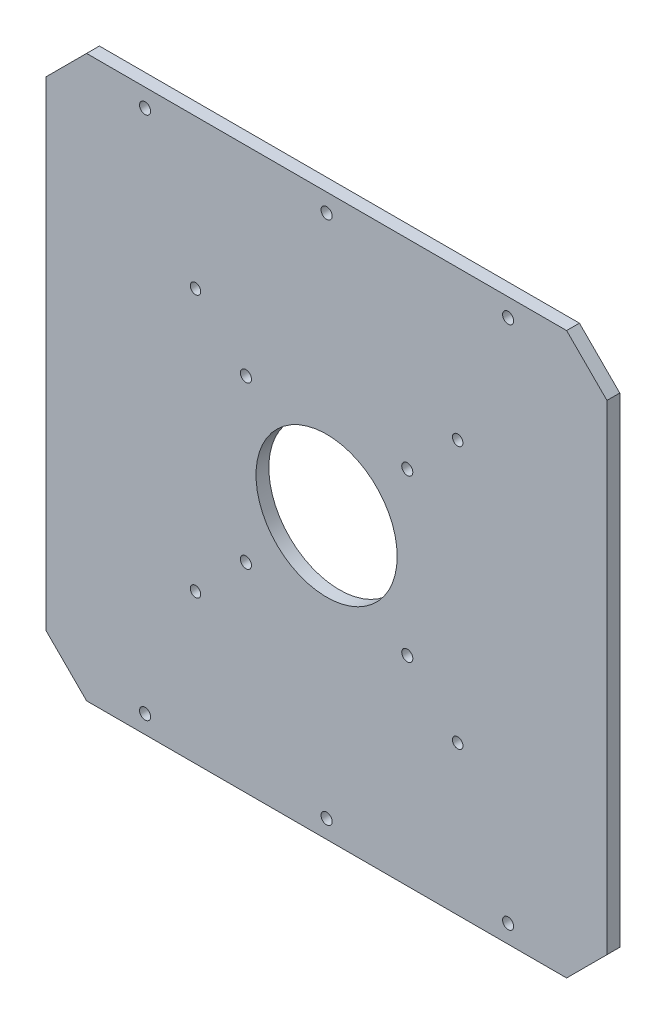
ISO-10303-21;
HEADER;
FILE_DESCRIPTION(('STEP AP214'),'2;1');
FILE_NAME('part.step','',(''),(''),'','','');
FILE_SCHEMA(('AUTOMOTIVE_DESIGN { 1 0 10303 214 1 1 1 1 }'));
ENDSEC;
DATA;
#1=APPLICATION_CONTEXT('core data for automotive mechanical design processes');
#2=APPLICATION_PROTOCOL_DEFINITION('international standard','automotive_design',2000,#1);
#3=PRODUCT_CONTEXT('',#1,'mechanical');
#4=PRODUCT('Part','Part','',(#3));
#5=PRODUCT_RELATED_PRODUCT_CATEGORY('part','',(#4));
#6=PRODUCT_DEFINITION_FORMATION('','',#4);
#7=PRODUCT_DEFINITION_CONTEXT('part definition',#1,'design');
#8=PRODUCT_DEFINITION('design','',#6,#7);
#9=PRODUCT_DEFINITION_SHAPE('','',#8);
#10=(LENGTH_UNIT() NAMED_UNIT(*) SI_UNIT(.MILLI.,.METRE.));
#11=(NAMED_UNIT(*) PLANE_ANGLE_UNIT() SI_UNIT($,.RADIAN.));
#12=(NAMED_UNIT(*) SI_UNIT($,.STERADIAN.) SOLID_ANGLE_UNIT());
#13=UNCERTAINTY_MEASURE_WITH_UNIT(LENGTH_MEASURE(1.E-05),#10,'distance_accuracy_value','');
#14=(GEOMETRIC_REPRESENTATION_CONTEXT(3) GLOBAL_UNCERTAINTY_ASSIGNED_CONTEXT((#13)) GLOBAL_UNIT_ASSIGNED_CONTEXT((#10,
#11,#12)) REPRESENTATION_CONTEXT('',''));
#15=CARTESIAN_POINT('',(0.,0.,0.));
#16=DIRECTION('',(0.,0.,1.));
#17=DIRECTION('',(1.,0.,0.));
#18=AXIS2_PLACEMENT_3D('',#15,#16,#17);
#19=CARTESIAN_POINT('',(-139.,-139.,6.35));
#20=DIRECTION('',(1.,0.,0.));
#21=DIRECTION('',(0.,0.,-1.));
#22=AXIS2_PLACEMENT_3D('',#19,#20,#21);
#23=PLANE('',#22);
#24=DIRECTION('',(0.,-1.,0.));
#25=VECTOR('',#24,1.);
#26=CARTESIAN_POINT('',(-139.,-139.,6.35));
#27=LINE('',#26,#25);
#28=CARTESIAN_POINT('',(-139.,119.,6.35));
#29=VERTEX_POINT('',#28);
#30=CARTESIAN_POINT('',(-139.,-119.,6.35));
#31=VERTEX_POINT('',#30);
#32=EDGE_CURVE('E130',#29,#31,#27,.T.);
#33=ORIENTED_EDGE('',*,*,#32,.F.);
#34=DIRECTION('',(0.,0.,-1.));
#35=VECTOR('',#34,1.);
#36=CARTESIAN_POINT('',(-139.,119.,6.35));
#37=LINE('',#36,#35);
#38=CARTESIAN_POINT('',(-139.,119.,0.));
#39=VERTEX_POINT('',#38);
#40=EDGE_CURVE('E11',#29,#39,#37,.T.);
#41=ORIENTED_EDGE('',*,*,#40,.T.);
#42=DIRECTION('',(0.,-1.,0.));
#43=VECTOR('',#42,1.);
#44=CARTESIAN_POINT('',(-139.,-139.,0.));
#45=LINE('',#44,#43);
#46=CARTESIAN_POINT('',(-139.,-119.,0.));
#47=VERTEX_POINT('',#46);
#48=EDGE_CURVE('E132',#39,#47,#45,.T.);
#49=ORIENTED_EDGE('',*,*,#48,.T.);
#50=DIRECTION('',(0.,0.,1.));
#51=VECTOR('',#50,1.);
#52=CARTESIAN_POINT('',(-139.,-119.,6.35));
#53=LINE('',#52,#51);
#54=EDGE_CURVE('E42',#47,#31,#53,.T.);
#55=ORIENTED_EDGE('',*,*,#54,.T.);
#56=EDGE_LOOP('',(#33,#41,#49,#55));
#57=FACE_BOUND('',#56,.T.);
#58=ADVANCED_FACE('F33',(#57),#23,.F.);
#59=CARTESIAN_POINT('',(139.,-139.,6.35));
#60=DIRECTION('',(0.,1.,0.));
#61=DIRECTION('',(0.,0.,1.));
#62=AXIS2_PLACEMENT_3D('',#59,#60,#61);
#63=PLANE('',#62);
#64=DIRECTION('',(1.,0.,0.));
#65=VECTOR('',#64,1.);
#66=CARTESIAN_POINT('',(139.,-139.,0.));
#67=LINE('',#66,#65);
#68=CARTESIAN_POINT('',(-119.,-139.,0.));
#69=VERTEX_POINT('',#68);
#70=CARTESIAN_POINT('',(119.,-139.,0.));
#71=VERTEX_POINT('',#70);
#72=EDGE_CURVE('E128',#69,#71,#67,.T.);
#73=ORIENTED_EDGE('',*,*,#72,.T.);
#74=DIRECTION('',(0.,0.,1.));
#75=VECTOR('',#74,1.);
#76=CARTESIAN_POINT('',(119.,-139.,6.35));
#77=LINE('',#76,#75);
#78=CARTESIAN_POINT('',(119.,-139.,6.35));
#79=VERTEX_POINT('',#78);
#80=EDGE_CURVE('E107',#71,#79,#77,.T.);
#81=ORIENTED_EDGE('',*,*,#80,.T.);
#82=DIRECTION('',(1.,0.,0.));
#83=VECTOR('',#82,1.);
#84=CARTESIAN_POINT('',(139.,-139.,6.35));
#85=LINE('',#84,#83);
#86=CARTESIAN_POINT('',(-119.,-139.,6.35));
#87=VERTEX_POINT('',#86);
#88=EDGE_CURVE('E226',#87,#79,#85,.T.);
#89=ORIENTED_EDGE('',*,*,#88,.F.);
#90=DIRECTION('',(0.,0.,-1.));
#91=VECTOR('',#90,1.);
#92=CARTESIAN_POINT('',(-119.,-139.,6.35));
#93=LINE('',#92,#91);
#94=EDGE_CURVE('E112',#87,#69,#93,.T.);
#95=ORIENTED_EDGE('',*,*,#94,.T.);
#96=EDGE_LOOP('',(#73,#81,#89,#95));
#97=FACE_BOUND('',#96,.T.);
#98=ADVANCED_FACE('F242',(#97),#63,.F.);
#99=CARTESIAN_POINT('',(139.,-139.,6.35));
#100=DIRECTION('',(-1.,0.,0.));
#101=DIRECTION('',(0.,0.,1.));
#102=AXIS2_PLACEMENT_3D('',#99,#100,#101);
#103=PLANE('',#102);
#104=DIRECTION('',(0.,1.,0.));
#105=VECTOR('',#104,1.);
#106=CARTESIAN_POINT('',(139.,-139.,6.35));
#107=LINE('',#106,#105);
#108=CARTESIAN_POINT('',(139.,-119.,6.35));
#109=VERTEX_POINT('',#108);
#110=CARTESIAN_POINT('',(139.,119.,6.35));
#111=VERTEX_POINT('',#110);
#112=EDGE_CURVE('E121',#109,#111,#107,.T.);
#113=ORIENTED_EDGE('',*,*,#112,.F.);
#114=DIRECTION('',(0.,0.,-1.));
#115=VECTOR('',#114,1.);
#116=CARTESIAN_POINT('',(139.,-119.,6.35));
#117=LINE('',#116,#115);
#118=CARTESIAN_POINT('',(139.,-119.,0.));
#119=VERTEX_POINT('',#118);
#120=EDGE_CURVE('E106',#109,#119,#117,.T.);
#121=ORIENTED_EDGE('',*,*,#120,.T.);
#122=DIRECTION('',(0.,1.,0.));
#123=VECTOR('',#122,1.);
#124=CARTESIAN_POINT('',(139.,-139.,0.));
#125=LINE('',#124,#123);
#126=CARTESIAN_POINT('',(139.,119.,0.));
#127=VERTEX_POINT('',#126);
#128=EDGE_CURVE('E119',#119,#127,#125,.T.);
#129=ORIENTED_EDGE('',*,*,#128,.T.);
#130=DIRECTION('',(0.,0.,1.));
#131=VECTOR('',#130,1.);
#132=CARTESIAN_POINT('',(139.,119.,6.35));
#133=LINE('',#132,#131);
#134=EDGE_CURVE('E123',#127,#111,#133,.T.);
#135=ORIENTED_EDGE('',*,*,#134,.T.);
#136=EDGE_LOOP('',(#113,#121,#129,#135));
#137=FACE_BOUND('',#136,.T.);
#138=ADVANCED_FACE('F118',(#137),#103,.F.);
#139=CARTESIAN_POINT('',(139.,139.,6.35));
#140=DIRECTION('',(0.,-1.,0.));
#141=DIRECTION('',(0.,0.,-1.));
#142=AXIS2_PLACEMENT_3D('',#139,#140,#141);
#143=PLANE('',#142);
#144=DIRECTION('',(-1.,0.,0.));
#145=VECTOR('',#144,1.);
#146=CARTESIAN_POINT('',(139.,139.,6.35));
#147=LINE('',#146,#145);
#148=CARTESIAN_POINT('',(119.,139.,6.35));
#149=VERTEX_POINT('',#148);
#150=CARTESIAN_POINT('',(-119.,139.,6.35));
#151=VERTEX_POINT('',#150);
#152=EDGE_CURVE('E136',#149,#151,#147,.T.);
#153=ORIENTED_EDGE('',*,*,#152,.F.);
#154=DIRECTION('',(0.,0.,-1.));
#155=VECTOR('',#154,1.);
#156=CARTESIAN_POINT('',(119.,139.,6.35));
#157=LINE('',#156,#155);
#158=CARTESIAN_POINT('',(119.,139.,0.));
#159=VERTEX_POINT('',#158);
#160=EDGE_CURVE('E153',#149,#159,#157,.T.);
#161=ORIENTED_EDGE('',*,*,#160,.T.);
#162=DIRECTION('',(-1.,0.,0.));
#163=VECTOR('',#162,1.);
#164=CARTESIAN_POINT('',(139.,139.,0.));
#165=LINE('',#164,#163);
#166=CARTESIAN_POINT('',(-119.,139.,0.));
#167=VERTEX_POINT('',#166);
#168=EDGE_CURVE('E127',#159,#167,#165,.T.);
#169=ORIENTED_EDGE('',*,*,#168,.T.);
#170=DIRECTION('',(0.,0.,1.));
#171=VECTOR('',#170,1.);
#172=CARTESIAN_POINT('',(-119.,139.,6.35));
#173=LINE('',#172,#171);
#174=EDGE_CURVE('E50',#167,#151,#173,.T.);
#175=ORIENTED_EDGE('',*,*,#174,.T.);
#176=EDGE_LOOP('',(#153,#161,#169,#175));
#177=FACE_BOUND('',#176,.T.);
#178=ADVANCED_FACE('F249',(#177),#143,.F.);
#179=CARTESIAN_POINT('',(0.,0.,6.35));
#180=DIRECTION('',(0.,0.,1.));
#181=DIRECTION('',(1.,0.,0.));
#182=AXIS2_PLACEMENT_3D('',#179,#180,#181);
#183=PLANE('',#182);
#184=CARTESIAN_POINT('',(65.,65.,6.35));
#185=DIRECTION('',(0.,0.,-1.));
#186=DIRECTION('',(1.,0.,0.));
#187=AXIS2_PLACEMENT_3D('',#184,#185,#186);
#188=CIRCLE('',#187,2.6);
#189=CARTESIAN_POINT('',(67.6,65.,6.35));
#190=VERTEX_POINT('',#189);
#191=EDGE_CURVE('E340',#190,#190,#188,.T.);
#192=ORIENTED_EDGE('',*,*,#191,.T.);
#193=EDGE_LOOP('',(#192));
#194=FACE_BOUND('',#193,.T.);
#195=CARTESIAN_POINT('',(65.,-65.,6.35));
#196=DIRECTION('',(0.,0.,-1.));
#197=DIRECTION('',(-1.,0.,0.));
#198=AXIS2_PLACEMENT_3D('',#195,#196,#197);
#199=CIRCLE('',#198,2.6);
#200=CARTESIAN_POINT('',(62.4,-65.,6.35));
#201=VERTEX_POINT('',#200);
#202=EDGE_CURVE('E348',#201,#201,#199,.T.);
#203=ORIENTED_EDGE('',*,*,#202,.T.);
#204=EDGE_LOOP('',(#203));
#205=FACE_BOUND('',#204,.T.);
#206=CARTESIAN_POINT('',(-65.,-65.,6.35));
#207=DIRECTION('',(0.,0.,-1.));
#208=DIRECTION('',(1.,0.,0.));
#209=AXIS2_PLACEMENT_3D('',#206,#207,#208);
#210=CIRCLE('',#209,2.6);
#211=CARTESIAN_POINT('',(-62.4,-65.,6.35));
#212=VERTEX_POINT('',#211);
#213=EDGE_CURVE('E354',#212,#212,#210,.T.);
#214=ORIENTED_EDGE('',*,*,#213,.T.);
#215=EDGE_LOOP('',(#214));
#216=FACE_BOUND('',#215,.T.);
#217=CARTESIAN_POINT('',(-65.,65.,6.35));
#218=DIRECTION('',(0.,0.,-1.));
#219=DIRECTION('',(-1.,0.,0.));
#220=AXIS2_PLACEMENT_3D('',#217,#218,#219);
#221=CIRCLE('',#220,2.6);
#222=CARTESIAN_POINT('',(-67.6,65.,6.35));
#223=VERTEX_POINT('',#222);
#224=EDGE_CURVE('E360',#223,#223,#221,.T.);
#225=ORIENTED_EDGE('',*,*,#224,.T.);
#226=EDGE_LOOP('',(#225));
#227=FACE_BOUND('',#226,.T.);
#228=CARTESIAN_POINT('',(-90.,-130.,6.35));
#229=DIRECTION('',(0.,0.,1.));
#230=DIRECTION('',(-1.,0.,0.));
#231=AXIS2_PLACEMENT_3D('',#228,#229,#230);
#232=CIRCLE('',#231,2.75000000000001);
#233=CARTESIAN_POINT('',(-92.75,-130.,6.35));
#234=VERTEX_POINT('',#233);
#235=EDGE_CURVE('E185',#234,#234,#232,.T.);
#236=ORIENTED_EDGE('',*,*,#235,.F.);
#237=EDGE_LOOP('',(#236));
#238=FACE_BOUND('',#237,.T.);
#239=CARTESIAN_POINT('',(0.,-130.,6.35));
#240=DIRECTION('',(0.,0.,1.));
#241=DIRECTION('',(-1.,0.,0.));
#242=AXIS2_PLACEMENT_3D('',#239,#240,#241);
#243=CIRCLE('',#242,2.75);
#244=CARTESIAN_POINT('',(-2.74999999999996,-130.,6.35));
#245=VERTEX_POINT('',#244);
#246=EDGE_CURVE('E175',#245,#245,#243,.T.);
#247=ORIENTED_EDGE('',*,*,#246,.F.);
#248=EDGE_LOOP('',(#247));
#249=FACE_BOUND('',#248,.T.);
#250=CARTESIAN_POINT('',(90.0000000000001,-130.,6.35));
#251=DIRECTION('',(0.,0.,1.));
#252=DIRECTION('',(1.,0.,0.));
#253=AXIS2_PLACEMENT_3D('',#250,#251,#252);
#254=CIRCLE('',#253,2.75000000000001);
#255=CARTESIAN_POINT('',(92.7500000000001,-130.,6.35));
#256=VERTEX_POINT('',#255);
#257=EDGE_CURVE('E172',#256,#256,#254,.T.);
#258=ORIENTED_EDGE('',*,*,#257,.F.);
#259=EDGE_LOOP('',(#258));
#260=FACE_BOUND('',#259,.T.);
#261=CARTESIAN_POINT('',(90.,130.,6.35));
#262=DIRECTION('',(0.,0.,1.));
#263=DIRECTION('',(-1.,0.,0.));
#264=AXIS2_PLACEMENT_3D('',#261,#262,#263);
#265=CIRCLE('',#264,2.75000000000001);
#266=CARTESIAN_POINT('',(87.25,130.,6.35));
#267=VERTEX_POINT('',#266);
#268=EDGE_CURVE('E169',#267,#267,#265,.T.);
#269=ORIENTED_EDGE('',*,*,#268,.F.);
#270=EDGE_LOOP('',(#269));
#271=FACE_BOUND('',#270,.T.);
#272=CARTESIAN_POINT('',(0.,130.,6.35));
#273=DIRECTION('',(0.,0.,1.));
#274=DIRECTION('',(1.,0.,0.));
#275=AXIS2_PLACEMENT_3D('',#272,#273,#274);
#276=CIRCLE('',#275,2.75);
#277=CARTESIAN_POINT('',(2.75000000000002,130.,6.35));
#278=VERTEX_POINT('',#277);
#279=EDGE_CURVE('E165',#278,#278,#276,.T.);
#280=ORIENTED_EDGE('',*,*,#279,.F.);
#281=EDGE_LOOP('',(#280));
#282=FACE_BOUND('',#281,.T.);
#283=CARTESIAN_POINT('',(-90.,130.,6.35));
#284=DIRECTION('',(0.,0.,1.));
#285=DIRECTION('',(1.,0.,0.));
#286=AXIS2_PLACEMENT_3D('',#283,#284,#285);
#287=CIRCLE('',#286,2.75000000000001);
#288=CARTESIAN_POINT('',(-87.25,130.,6.35));
#289=VERTEX_POINT('',#288);
#290=EDGE_CURVE('E161',#289,#289,#287,.T.);
#291=ORIENTED_EDGE('',*,*,#290,.F.);
#292=EDGE_LOOP('',(#291));
#293=FACE_BOUND('',#292,.T.);
#294=CARTESIAN_POINT('',(-40.,-40.,6.35));
#295=DIRECTION('',(0.,0.,1.));
#296=DIRECTION('',(-1.,0.,0.));
#297=AXIS2_PLACEMENT_3D('',#294,#295,#296);
#298=CIRCLE('',#297,2.75);
#299=CARTESIAN_POINT('',(-42.75,-40.,6.35));
#300=VERTEX_POINT('',#299);
#301=EDGE_CURVE('E160',#300,#300,#298,.T.);
#302=ORIENTED_EDGE('',*,*,#301,.F.);
#303=EDGE_LOOP('',(#302));
#304=FACE_BOUND('',#303,.T.);
#305=CARTESIAN_POINT('',(40.,-40.,6.35));
#306=DIRECTION('',(0.,0.,1.));
#307=DIRECTION('',(1.,0.,0.));
#308=AXIS2_PLACEMENT_3D('',#305,#306,#307);
#309=CIRCLE('',#308,2.75);
#310=CARTESIAN_POINT('',(42.75,-40.,6.35));
#311=VERTEX_POINT('',#310);
#312=EDGE_CURVE('E198',#311,#311,#309,.T.);
#313=ORIENTED_EDGE('',*,*,#312,.F.);
#314=EDGE_LOOP('',(#313));
#315=FACE_BOUND('',#314,.T.);
#316=CARTESIAN_POINT('',(40.,40.,6.35));
#317=DIRECTION('',(0.,0.,1.));
#318=DIRECTION('',(-1.,0.,0.));
#319=AXIS2_PLACEMENT_3D('',#316,#317,#318);
#320=CIRCLE('',#319,2.75);
#321=CARTESIAN_POINT('',(37.25,40.,6.35));
#322=VERTEX_POINT('',#321);
#323=EDGE_CURVE('E204',#322,#322,#320,.T.);
#324=ORIENTED_EDGE('',*,*,#323,.F.);
#325=EDGE_LOOP('',(#324));
#326=FACE_BOUND('',#325,.T.);
#327=CARTESIAN_POINT('',(-40.,40.,6.35));
#328=DIRECTION('',(0.,0.,1.));
#329=DIRECTION('',(1.,0.,0.));
#330=AXIS2_PLACEMENT_3D('',#327,#328,#329);
#331=CIRCLE('',#330,2.75);
#332=CARTESIAN_POINT('',(-37.25,40.,6.35));
#333=VERTEX_POINT('',#332);
#334=EDGE_CURVE('E210',#333,#333,#331,.T.);
#335=ORIENTED_EDGE('',*,*,#334,.F.);
#336=EDGE_LOOP('',(#335));
#337=FACE_BOUND('',#336,.T.);
#338=CARTESIAN_POINT('',(0.,0.,6.35));
#339=DIRECTION('',(0.,0.,1.));
#340=DIRECTION('',(1.,0.,0.));
#341=AXIS2_PLACEMENT_3D('',#338,#339,#340);
#342=CIRCLE('',#341,35.);
#343=CARTESIAN_POINT('',(35.,0.,6.35));
#344=VERTEX_POINT('',#343);
#345=EDGE_CURVE('E216',#344,#344,#342,.T.);
#346=ORIENTED_EDGE('',*,*,#345,.F.);
#347=EDGE_LOOP('',(#346));
#348=FACE_BOUND('',#347,.T.);
#349=ORIENTED_EDGE('',*,*,#88,.T.);
#350=DIRECTION('',(-0.70710678118655,-0.707106781186546,0.));
#351=VECTOR('',#350,1.);
#352=CARTESIAN_POINT('',(129.,-129.,6.35));
#353=LINE('',#352,#351);
#354=EDGE_CURVE('E150',#79,#109,#353,.F.);
#355=ORIENTED_EDGE('',*,*,#354,.T.);
#356=ORIENTED_EDGE('',*,*,#112,.T.);
#357=DIRECTION('',(0.707106781186546,-0.70710678118655,0.));
#358=VECTOR('',#357,1.);
#359=CARTESIAN_POINT('',(129.,129.,6.35));
#360=LINE('',#359,#358);
#361=EDGE_CURVE('E57',#111,#149,#360,.F.);
#362=ORIENTED_EDGE('',*,*,#361,.T.);
#363=ORIENTED_EDGE('',*,*,#152,.T.);
#364=DIRECTION('',(0.70710678118655,0.707106781186546,0.));
#365=VECTOR('',#364,1.);
#366=CARTESIAN_POINT('',(-129.,129.,6.35));
#367=LINE('',#366,#365);
#368=EDGE_CURVE('E147',#151,#29,#367,.F.);
#369=ORIENTED_EDGE('',*,*,#368,.T.);
#370=ORIENTED_EDGE('',*,*,#32,.T.);
#371=DIRECTION('',(-0.707106781186546,0.70710678118655,0.));
#372=VECTOR('',#371,1.);
#373=CARTESIAN_POINT('',(-129.,-129.,6.35));
#374=LINE('',#373,#372);
#375=EDGE_CURVE('E145',#31,#87,#374,.F.);
#376=ORIENTED_EDGE('',*,*,#375,.T.);
#377=EDGE_LOOP('',(#349,#355,#356,#362,#363,#369,#370,#376));
#378=FACE_BOUND('',#377,.T.);
#379=ADVANCED_FACE('F240',(#194,#205,#216,#227,#238,#249,#260,#271,#282,#293,#304,#315,#326,
#337,#348,#378),#183,.T.);
#380=CARTESIAN_POINT('',(0.,0.,0.));
#381=DIRECTION('',(0.,0.,1.));
#382=DIRECTION('',(1.,0.,0.));
#383=AXIS2_PLACEMENT_3D('',#380,#381,#382);
#384=PLANE('',#383);
#385=CARTESIAN_POINT('',(65.,65.,0.));
#386=DIRECTION('',(0.,0.,-1.));
#387=DIRECTION('',(1.,0.,0.));
#388=AXIS2_PLACEMENT_3D('',#385,#386,#387);
#389=CIRCLE('',#388,2.6);
#390=CARTESIAN_POINT('',(67.6,65.,0.));
#391=VERTEX_POINT('',#390);
#392=EDGE_CURVE('E343',#391,#391,#389,.T.);
#393=ORIENTED_EDGE('',*,*,#392,.F.);
#394=EDGE_LOOP('',(#393));
#395=FACE_BOUND('',#394,.T.);
#396=CARTESIAN_POINT('',(65.,-65.,0.));
#397=DIRECTION('',(0.,0.,-1.));
#398=DIRECTION('',(-1.,0.,0.));
#399=AXIS2_PLACEMENT_3D('',#396,#397,#398);
#400=CIRCLE('',#399,2.6);
#401=CARTESIAN_POINT('',(62.4,-65.,0.));
#402=VERTEX_POINT('',#401);
#403=EDGE_CURVE('E345',#402,#402,#400,.T.);
#404=ORIENTED_EDGE('',*,*,#403,.F.);
#405=EDGE_LOOP('',(#404));
#406=FACE_BOUND('',#405,.T.);
#407=CARTESIAN_POINT('',(-65.,-65.,0.));
#408=DIRECTION('',(0.,0.,-1.));
#409=DIRECTION('',(1.,0.,0.));
#410=AXIS2_PLACEMENT_3D('',#407,#408,#409);
#411=CIRCLE('',#410,2.6);
#412=CARTESIAN_POINT('',(-62.4,-65.,0.));
#413=VERTEX_POINT('',#412);
#414=EDGE_CURVE('E351',#413,#413,#411,.T.);
#415=ORIENTED_EDGE('',*,*,#414,.F.);
#416=EDGE_LOOP('',(#415));
#417=FACE_BOUND('',#416,.T.);
#418=CARTESIAN_POINT('',(-65.,65.,0.));
#419=DIRECTION('',(0.,0.,-1.));
#420=DIRECTION('',(-1.,0.,0.));
#421=AXIS2_PLACEMENT_3D('',#418,#419,#420);
#422=CIRCLE('',#421,2.6);
#423=CARTESIAN_POINT('',(-67.6,65.,0.));
#424=VERTEX_POINT('',#423);
#425=EDGE_CURVE('E357',#424,#424,#422,.T.);
#426=ORIENTED_EDGE('',*,*,#425,.F.);
#427=EDGE_LOOP('',(#426));
#428=FACE_BOUND('',#427,.T.);
#429=CARTESIAN_POINT('',(-90.,-130.,0.));
#430=DIRECTION('',(0.,0.,1.));
#431=DIRECTION('',(1.,0.,0.));
#432=AXIS2_PLACEMENT_3D('',#429,#430,#431);
#433=CIRCLE('',#432,2.75000000000001);
#434=CARTESIAN_POINT('',(-87.25,-130.,0.));
#435=VERTEX_POINT('',#434);
#436=EDGE_CURVE('E37',#435,#435,#433,.T.);
#437=ORIENTED_EDGE('',*,*,#436,.T.);
#438=EDGE_LOOP('',(#437));
#439=FACE_BOUND('',#438,.T.);
#440=CARTESIAN_POINT('',(0.,-130.,0.));
#441=DIRECTION('',(0.,0.,1.));
#442=DIRECTION('',(1.,0.,0.));
#443=AXIS2_PLACEMENT_3D('',#440,#441,#442);
#444=CIRCLE('',#443,2.75);
#445=CARTESIAN_POINT('',(2.75000000000005,-130.,0.));
#446=VERTEX_POINT('',#445);
#447=EDGE_CURVE('E173',#446,#446,#444,.T.);
#448=ORIENTED_EDGE('',*,*,#447,.T.);
#449=EDGE_LOOP('',(#448));
#450=FACE_BOUND('',#449,.T.);
#451=CARTESIAN_POINT('',(90.0000000000001,-130.,0.));
#452=DIRECTION('',(0.,0.,1.));
#453=DIRECTION('',(1.,0.,0.));
#454=AXIS2_PLACEMENT_3D('',#451,#452,#453);
#455=CIRCLE('',#454,2.75000000000001);
#456=CARTESIAN_POINT('',(92.7500000000001,-130.,0.));
#457=VERTEX_POINT('',#456);
#458=EDGE_CURVE('E170',#457,#457,#455,.T.);
#459=ORIENTED_EDGE('',*,*,#458,.T.);
#460=EDGE_LOOP('',(#459));
#461=FACE_BOUND('',#460,.T.);
#462=CARTESIAN_POINT('',(90.,130.,0.));
#463=DIRECTION('',(0.,0.,1.));
#464=DIRECTION('',(1.,0.,0.));
#465=AXIS2_PLACEMENT_3D('',#462,#463,#464);
#466=CIRCLE('',#465,2.75000000000001);
#467=CARTESIAN_POINT('',(92.75,130.,0.));
#468=VERTEX_POINT('',#467);
#469=EDGE_CURVE('E166',#468,#468,#466,.T.);
#470=ORIENTED_EDGE('',*,*,#469,.T.);
#471=EDGE_LOOP('',(#470));
#472=FACE_BOUND('',#471,.T.);
#473=CARTESIAN_POINT('',(0.,130.,0.));
#474=DIRECTION('',(0.,0.,1.));
#475=DIRECTION('',(1.,0.,0.));
#476=AXIS2_PLACEMENT_3D('',#473,#474,#475);
#477=CIRCLE('',#476,2.75);
#478=CARTESIAN_POINT('',(2.75000000000002,130.,0.));
#479=VERTEX_POINT('',#478);
#480=EDGE_CURVE('E162',#479,#479,#477,.T.);
#481=ORIENTED_EDGE('',*,*,#480,.T.);
#482=EDGE_LOOP('',(#481));
#483=FACE_BOUND('',#482,.T.);
#484=CARTESIAN_POINT('',(-90.,130.,0.));
#485=DIRECTION('',(0.,0.,1.));
#486=DIRECTION('',(1.,0.,0.));
#487=AXIS2_PLACEMENT_3D('',#484,#485,#486);
#488=CIRCLE('',#487,2.75000000000001);
#489=CARTESIAN_POINT('',(-87.25,130.,0.));
#490=VERTEX_POINT('',#489);
#491=EDGE_CURVE('E157',#490,#490,#488,.T.);
#492=ORIENTED_EDGE('',*,*,#491,.T.);
#493=EDGE_LOOP('',(#492));
#494=FACE_BOUND('',#493,.T.);
#495=CARTESIAN_POINT('',(-40.,-40.,0.));
#496=DIRECTION('',(0.,0.,1.));
#497=DIRECTION('',(-1.,0.,0.));
#498=AXIS2_PLACEMENT_3D('',#495,#496,#497);
#499=CIRCLE('',#498,2.75);
#500=CARTESIAN_POINT('',(-42.75,-40.,0.));
#501=VERTEX_POINT('',#500);
#502=EDGE_CURVE('E195',#501,#501,#499,.T.);
#503=ORIENTED_EDGE('',*,*,#502,.T.);
#504=EDGE_LOOP('',(#503));
#505=FACE_BOUND('',#504,.T.);
#506=CARTESIAN_POINT('',(40.,-40.,0.));
#507=DIRECTION('',(0.,0.,1.));
#508=DIRECTION('',(1.,0.,0.));
#509=AXIS2_PLACEMENT_3D('',#506,#507,#508);
#510=CIRCLE('',#509,2.75);
#511=CARTESIAN_POINT('',(42.75,-40.,0.));
#512=VERTEX_POINT('',#511);
#513=EDGE_CURVE('E201',#512,#512,#510,.T.);
#514=ORIENTED_EDGE('',*,*,#513,.T.);
#515=EDGE_LOOP('',(#514));
#516=FACE_BOUND('',#515,.T.);
#517=CARTESIAN_POINT('',(40.,40.,0.));
#518=DIRECTION('',(0.,0.,1.));
#519=DIRECTION('',(-1.,0.,0.));
#520=AXIS2_PLACEMENT_3D('',#517,#518,#519);
#521=CIRCLE('',#520,2.75);
#522=CARTESIAN_POINT('',(37.25,40.,0.));
#523=VERTEX_POINT('',#522);
#524=EDGE_CURVE('E207',#523,#523,#521,.T.);
#525=ORIENTED_EDGE('',*,*,#524,.T.);
#526=EDGE_LOOP('',(#525));
#527=FACE_BOUND('',#526,.T.);
#528=CARTESIAN_POINT('',(-40.,40.,0.));
#529=DIRECTION('',(0.,0.,1.));
#530=DIRECTION('',(1.,0.,0.));
#531=AXIS2_PLACEMENT_3D('',#528,#529,#530);
#532=CIRCLE('',#531,2.75);
#533=CARTESIAN_POINT('',(-37.25,40.,0.));
#534=VERTEX_POINT('',#533);
#535=EDGE_CURVE('E213',#534,#534,#532,.T.);
#536=ORIENTED_EDGE('',*,*,#535,.T.);
#537=EDGE_LOOP('',(#536));
#538=FACE_BOUND('',#537,.T.);
#539=CARTESIAN_POINT('',(0.,0.,0.));
#540=DIRECTION('',(0.,0.,1.));
#541=DIRECTION('',(1.,0.,0.));
#542=AXIS2_PLACEMENT_3D('',#539,#540,#541);
#543=CIRCLE('',#542,35.);
#544=CARTESIAN_POINT('',(35.,0.,0.));
#545=VERTEX_POINT('',#544);
#546=EDGE_CURVE('E219',#545,#545,#543,.T.);
#547=ORIENTED_EDGE('',*,*,#546,.T.);
#548=EDGE_LOOP('',(#547));
#549=FACE_BOUND('',#548,.T.);
#550=ORIENTED_EDGE('',*,*,#128,.F.);
#551=DIRECTION('',(0.70710678118655,0.707106781186546,0.));
#552=VECTOR('',#551,1.);
#553=CARTESIAN_POINT('',(139.,-119.,0.));
#554=LINE('',#553,#552);
#555=EDGE_CURVE('E102',#119,#71,#554,.F.);
#556=ORIENTED_EDGE('',*,*,#555,.T.);
#557=ORIENTED_EDGE('',*,*,#72,.F.);
#558=DIRECTION('',(0.707106781186546,-0.70710678118655,0.));
#559=VECTOR('',#558,1.);
#560=CARTESIAN_POINT('',(-119.,-139.,0.));
#561=LINE('',#560,#559);
#562=EDGE_CURVE('E122',#69,#47,#561,.F.);
#563=ORIENTED_EDGE('',*,*,#562,.T.);
#564=ORIENTED_EDGE('',*,*,#48,.F.);
#565=DIRECTION('',(-0.70710678118655,-0.707106781186546,0.));
#566=VECTOR('',#565,1.);
#567=CARTESIAN_POINT('',(-139.,119.,0.));
#568=LINE('',#567,#566);
#569=EDGE_CURVE('E139',#39,#167,#568,.F.);
#570=ORIENTED_EDGE('',*,*,#569,.T.);
#571=ORIENTED_EDGE('',*,*,#168,.F.);
#572=DIRECTION('',(-0.707106781186546,0.70710678118655,0.));
#573=VECTOR('',#572,1.);
#574=CARTESIAN_POINT('',(119.,139.,0.));
#575=LINE('',#574,#573);
#576=EDGE_CURVE('E113',#159,#127,#575,.F.);
#577=ORIENTED_EDGE('',*,*,#576,.T.);
#578=EDGE_LOOP('',(#550,#556,#557,#563,#564,#570,#571,#577));
#579=FACE_BOUND('',#578,.T.);
#580=ADVANCED_FACE('F125',(#395,#406,#417,#428,#439,#450,#461,#472,#483,#494,#505,#516,#527,
#538,#549,#579),#384,.F.);
#581=CARTESIAN_POINT('',(0.,0.,0.));
#582=DIRECTION('',(0.,0.,1.));
#583=DIRECTION('',(1.,0.,0.));
#584=AXIS2_PLACEMENT_3D('',#581,#582,#583);
#585=CYLINDRICAL_SURFACE('',#584,35.);
#586=ORIENTED_EDGE('',*,*,#546,.F.);
#587=EDGE_LOOP('',(#586));
#588=FACE_BOUND('',#587,.T.);
#589=ORIENTED_EDGE('',*,*,#345,.T.);
#590=EDGE_LOOP('',(#589));
#591=FACE_BOUND('',#590,.T.);
#592=ADVANCED_FACE('F277',(#588,#591),#585,.F.);
#593=CARTESIAN_POINT('',(-40.,40.,0.));
#594=DIRECTION('',(0.,0.,1.));
#595=DIRECTION('',(1.,0.,0.));
#596=AXIS2_PLACEMENT_3D('',#593,#594,#595);
#597=CYLINDRICAL_SURFACE('',#596,2.75);
#598=ORIENTED_EDGE('',*,*,#535,.F.);
#599=EDGE_LOOP('',(#598));
#600=FACE_BOUND('',#599,.T.);
#601=ORIENTED_EDGE('',*,*,#334,.T.);
#602=EDGE_LOOP('',(#601));
#603=FACE_BOUND('',#602,.T.);
#604=ADVANCED_FACE('F282',(#600,#603),#597,.F.);
#605=CARTESIAN_POINT('',(40.,40.,0.));
#606=DIRECTION('',(0.,0.,1.));
#607=DIRECTION('',(1.,0.,0.));
#608=AXIS2_PLACEMENT_3D('',#605,#606,#607);
#609=CYLINDRICAL_SURFACE('',#608,2.75);
#610=ORIENTED_EDGE('',*,*,#524,.F.);
#611=EDGE_LOOP('',(#610));
#612=FACE_BOUND('',#611,.T.);
#613=ORIENTED_EDGE('',*,*,#323,.T.);
#614=EDGE_LOOP('',(#613));
#615=FACE_BOUND('',#614,.T.);
#616=ADVANCED_FACE('F286',(#612,#615),#609,.F.);
#617=CARTESIAN_POINT('',(40.,-40.,0.));
#618=DIRECTION('',(0.,0.,1.));
#619=DIRECTION('',(1.,0.,0.));
#620=AXIS2_PLACEMENT_3D('',#617,#618,#619);
#621=CYLINDRICAL_SURFACE('',#620,2.75);
#622=ORIENTED_EDGE('',*,*,#513,.F.);
#623=EDGE_LOOP('',(#622));
#624=FACE_BOUND('',#623,.T.);
#625=ORIENTED_EDGE('',*,*,#312,.T.);
#626=EDGE_LOOP('',(#625));
#627=FACE_BOUND('',#626,.T.);
#628=ADVANCED_FACE('F290',(#624,#627),#621,.F.);
#629=CARTESIAN_POINT('',(-40.,-40.,0.));
#630=DIRECTION('',(0.,0.,1.));
#631=DIRECTION('',(1.,0.,0.));
#632=AXIS2_PLACEMENT_3D('',#629,#630,#631);
#633=CYLINDRICAL_SURFACE('',#632,2.75);
#634=ORIENTED_EDGE('',*,*,#502,.F.);
#635=EDGE_LOOP('',(#634));
#636=FACE_BOUND('',#635,.T.);
#637=ORIENTED_EDGE('',*,*,#301,.T.);
#638=EDGE_LOOP('',(#637));
#639=FACE_BOUND('',#638,.T.);
#640=ADVANCED_FACE('F257',(#636,#639),#633,.F.);
#641=CARTESIAN_POINT('',(139.,-119.,6.35));
#642=DIRECTION('',(-0.707106781186545,0.707106781186549,0.));
#643=DIRECTION('',(0.,0.,-1.));
#644=AXIS2_PLACEMENT_3D('',#641,#642,#643);
#645=PLANE('',#644);
#646=ORIENTED_EDGE('',*,*,#354,.F.);
#647=ORIENTED_EDGE('',*,*,#80,.F.);
#648=ORIENTED_EDGE('',*,*,#555,.F.);
#649=ORIENTED_EDGE('',*,*,#120,.F.);
#650=EDGE_LOOP('',(#646,#647,#648,#649));
#651=FACE_BOUND('',#650,.T.);
#652=ADVANCED_FACE('F105',(#651),#645,.F.);
#653=CARTESIAN_POINT('',(119.,139.,6.35));
#654=DIRECTION('',(-0.707106781186549,-0.707106781186545,0.));
#655=DIRECTION('',(0.,0.,-1.));
#656=AXIS2_PLACEMENT_3D('',#653,#654,#655);
#657=PLANE('',#656);
#658=ORIENTED_EDGE('',*,*,#361,.F.);
#659=ORIENTED_EDGE('',*,*,#134,.F.);
#660=ORIENTED_EDGE('',*,*,#576,.F.);
#661=ORIENTED_EDGE('',*,*,#160,.F.);
#662=EDGE_LOOP('',(#658,#659,#660,#661));
#663=FACE_BOUND('',#662,.T.);
#664=ADVANCED_FACE('F256',(#663),#657,.F.);
#665=CARTESIAN_POINT('',(-139.,119.,6.35));
#666=DIRECTION('',(0.707106781186545,-0.707106781186549,0.));
#667=DIRECTION('',(0.,0.,-1.));
#668=AXIS2_PLACEMENT_3D('',#665,#666,#667);
#669=PLANE('',#668);
#670=ORIENTED_EDGE('',*,*,#368,.F.);
#671=ORIENTED_EDGE('',*,*,#174,.F.);
#672=ORIENTED_EDGE('',*,*,#569,.F.);
#673=ORIENTED_EDGE('',*,*,#40,.F.);
#674=EDGE_LOOP('',(#670,#671,#672,#673));
#675=FACE_BOUND('',#674,.T.);
#676=ADVANCED_FACE('F259',(#675),#669,.F.);
#677=CARTESIAN_POINT('',(-119.,-139.,6.35));
#678=DIRECTION('',(0.707106781186549,0.707106781186545,0.));
#679=DIRECTION('',(0.,0.,-1.));
#680=AXIS2_PLACEMENT_3D('',#677,#678,#679);
#681=PLANE('',#680);
#682=ORIENTED_EDGE('',*,*,#375,.F.);
#683=ORIENTED_EDGE('',*,*,#54,.F.);
#684=ORIENTED_EDGE('',*,*,#562,.F.);
#685=ORIENTED_EDGE('',*,*,#94,.F.);
#686=EDGE_LOOP('',(#682,#683,#684,#685));
#687=FACE_BOUND('',#686,.T.);
#688=ADVANCED_FACE('F35',(#687),#681,.F.);
#689=CARTESIAN_POINT('',(-90.,130.,-69.85));
#690=DIRECTION('',(0.,0.,1.));
#691=DIRECTION('',(1.,0.,0.));
#692=AXIS2_PLACEMENT_3D('',#689,#690,#691);
#693=CYLINDRICAL_SURFACE('',#692,2.75000000000001);
#694=ORIENTED_EDGE('',*,*,#290,.T.);
#695=EDGE_LOOP('',(#694));
#696=FACE_BOUND('',#695,.T.);
#697=ORIENTED_EDGE('',*,*,#491,.F.);
#698=EDGE_LOOP('',(#697));
#699=FACE_BOUND('',#698,.T.);
#700=ADVANCED_FACE('F266',(#696,#699),#693,.F.);
#701=CARTESIAN_POINT('',(0.,130.,-69.85));
#702=DIRECTION('',(0.,0.,1.));
#703=DIRECTION('',(1.,0.,0.));
#704=AXIS2_PLACEMENT_3D('',#701,#702,#703);
#705=CYLINDRICAL_SURFACE('',#704,2.75);
#706=ORIENTED_EDGE('',*,*,#279,.T.);
#707=EDGE_LOOP('',(#706));
#708=FACE_BOUND('',#707,.T.);
#709=ORIENTED_EDGE('',*,*,#480,.F.);
#710=EDGE_LOOP('',(#709));
#711=FACE_BOUND('',#710,.T.);
#712=ADVANCED_FACE('F300',(#708,#711),#705,.F.);
#713=CARTESIAN_POINT('',(90.,130.,-69.85));
#714=DIRECTION('',(0.,0.,1.));
#715=DIRECTION('',(1.,0.,0.));
#716=AXIS2_PLACEMENT_3D('',#713,#714,#715);
#717=CYLINDRICAL_SURFACE('',#716,2.75000000000001);
#718=ORIENTED_EDGE('',*,*,#268,.T.);
#719=EDGE_LOOP('',(#718));
#720=FACE_BOUND('',#719,.T.);
#721=ORIENTED_EDGE('',*,*,#469,.F.);
#722=EDGE_LOOP('',(#721));
#723=FACE_BOUND('',#722,.T.);
#724=ADVANCED_FACE('F304',(#720,#723),#717,.F.);
#725=CARTESIAN_POINT('',(90.0000000000001,-130.,-69.85));
#726=DIRECTION('',(0.,0.,1.));
#727=DIRECTION('',(1.,0.,0.));
#728=AXIS2_PLACEMENT_3D('',#725,#726,#727);
#729=CYLINDRICAL_SURFACE('',#728,2.75000000000001);
#730=ORIENTED_EDGE('',*,*,#257,.T.);
#731=EDGE_LOOP('',(#730));
#732=FACE_BOUND('',#731,.T.);
#733=ORIENTED_EDGE('',*,*,#458,.F.);
#734=EDGE_LOOP('',(#733));
#735=FACE_BOUND('',#734,.T.);
#736=ADVANCED_FACE('F308',(#732,#735),#729,.F.);
#737=CARTESIAN_POINT('',(0.,-130.,-69.85));
#738=DIRECTION('',(0.,0.,1.));
#739=DIRECTION('',(1.,0.,0.));
#740=AXIS2_PLACEMENT_3D('',#737,#738,#739);
#741=CYLINDRICAL_SURFACE('',#740,2.75);
#742=ORIENTED_EDGE('',*,*,#246,.T.);
#743=EDGE_LOOP('',(#742));
#744=FACE_BOUND('',#743,.T.);
#745=ORIENTED_EDGE('',*,*,#447,.F.);
#746=EDGE_LOOP('',(#745));
#747=FACE_BOUND('',#746,.T.);
#748=ADVANCED_FACE('F312',(#744,#747),#741,.F.);
#749=CARTESIAN_POINT('',(-90.,-130.,-69.85));
#750=DIRECTION('',(0.,0.,1.));
#751=DIRECTION('',(1.,0.,0.));
#752=AXIS2_PLACEMENT_3D('',#749,#750,#751);
#753=CYLINDRICAL_SURFACE('',#752,2.75000000000001);
#754=ORIENTED_EDGE('',*,*,#235,.T.);
#755=EDGE_LOOP('',(#754));
#756=FACE_BOUND('',#755,.T.);
#757=ORIENTED_EDGE('',*,*,#436,.F.);
#758=EDGE_LOOP('',(#757));
#759=FACE_BOUND('',#758,.T.);
#760=ADVANCED_FACE('F316',(#756,#759),#753,.F.);
#761=CARTESIAN_POINT('',(-65.,65.,6.35));
#762=DIRECTION('',(0.,0.,-1.));
#763=DIRECTION('',(-1.,0.,0.));
#764=AXIS2_PLACEMENT_3D('',#761,#762,#763);
#765=CYLINDRICAL_SURFACE('',#764,2.6);
#766=ORIENTED_EDGE('',*,*,#224,.F.);
#767=EDGE_LOOP('',(#766));
#768=FACE_BOUND('',#767,.T.);
#769=ORIENTED_EDGE('',*,*,#425,.T.);
#770=EDGE_LOOP('',(#769));
#771=FACE_BOUND('',#770,.T.);
#772=ADVANCED_FACE('F319',(#768,#771),#765,.F.);
#773=CARTESIAN_POINT('',(-65.,-65.,6.35));
#774=DIRECTION('',(0.,0.,-1.));
#775=DIRECTION('',(-1.,0.,0.));
#776=AXIS2_PLACEMENT_3D('',#773,#774,#775);
#777=CYLINDRICAL_SURFACE('',#776,2.6);
#778=ORIENTED_EDGE('',*,*,#213,.F.);
#779=EDGE_LOOP('',(#778));
#780=FACE_BOUND('',#779,.T.);
#781=ORIENTED_EDGE('',*,*,#414,.T.);
#782=EDGE_LOOP('',(#781));
#783=FACE_BOUND('',#782,.T.);
#784=ADVANCED_FACE('F323',(#780,#783),#777,.F.);
#785=CARTESIAN_POINT('',(65.,-65.,6.35));
#786=DIRECTION('',(0.,0.,-1.));
#787=DIRECTION('',(-1.,0.,0.));
#788=AXIS2_PLACEMENT_3D('',#785,#786,#787);
#789=CYLINDRICAL_SURFACE('',#788,2.6);
#790=ORIENTED_EDGE('',*,*,#202,.F.);
#791=EDGE_LOOP('',(#790));
#792=FACE_BOUND('',#791,.T.);
#793=ORIENTED_EDGE('',*,*,#403,.T.);
#794=EDGE_LOOP('',(#793));
#795=FACE_BOUND('',#794,.T.);
#796=ADVANCED_FACE('F327',(#792,#795),#789,.F.);
#797=CARTESIAN_POINT('',(65.,65.,6.35));
#798=DIRECTION('',(0.,0.,-1.));
#799=DIRECTION('',(-1.,0.,0.));
#800=AXIS2_PLACEMENT_3D('',#797,#798,#799);
#801=CYLINDRICAL_SURFACE('',#800,2.6);
#802=ORIENTED_EDGE('',*,*,#191,.F.);
#803=EDGE_LOOP('',(#802));
#804=FACE_BOUND('',#803,.T.);
#805=ORIENTED_EDGE('',*,*,#392,.T.);
#806=EDGE_LOOP('',(#805));
#807=FACE_BOUND('',#806,.T.);
#808=ADVANCED_FACE('F331',(#804,#807),#801,.F.);
#809=CLOSED_SHELL('',(#58,#98,#138,#178,#379,#580,#592,#604,#616,#628,#640,#652,#664,#676,#688,
#700,#712,#724,#736,#748,#760,#772,#784,#796,#808));
#810=MANIFOLD_SOLID_BREP('B2',#809);
#811=ADVANCED_BREP_SHAPE_REPRESENTATION('',(#18,#810),#14);
#812=SHAPE_DEFINITION_REPRESENTATION(#9,#811);
ENDSEC;
END-ISO-10303-21;
